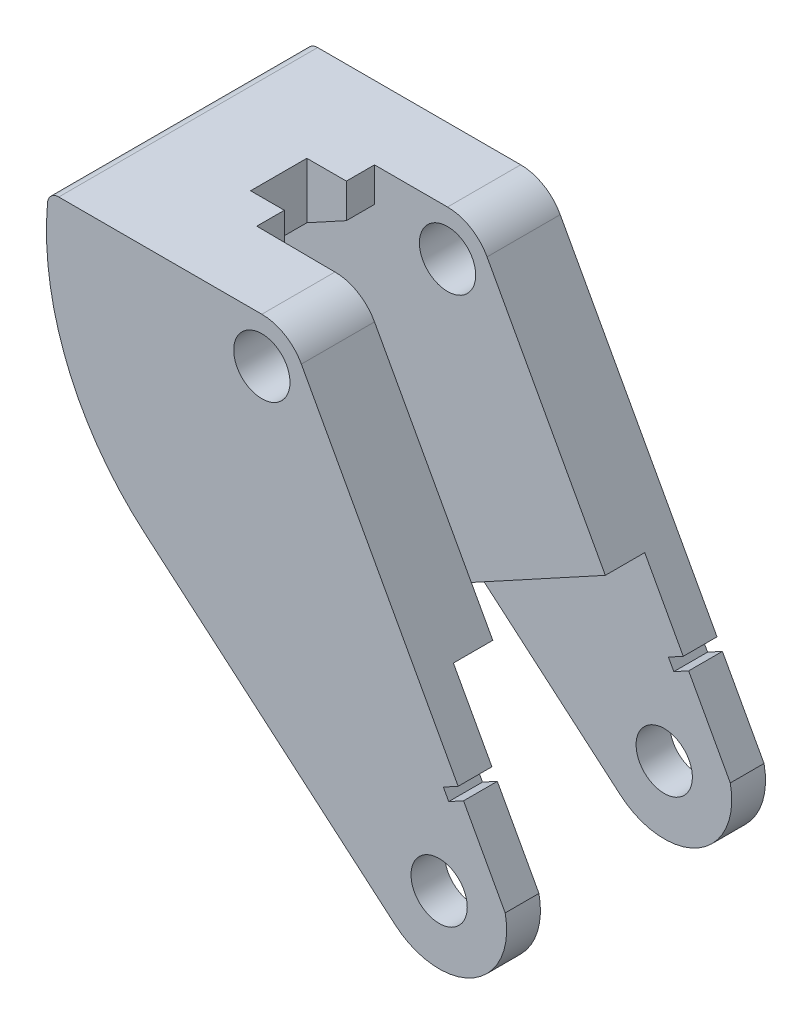
ISO-10303-21;
HEADER;
FILE_DESCRIPTION(('STEP AP214'),'2;1');
FILE_NAME('part.step','',(''),(''),'','','');
FILE_SCHEMA(('AUTOMOTIVE_DESIGN { 1 0 10303 214 1 1 1 1 }'));
ENDSEC;
DATA;
#1=APPLICATION_CONTEXT('core data for automotive mechanical design processes');
#2=APPLICATION_PROTOCOL_DEFINITION('international standard','automotive_design',2000,#1);
#3=PRODUCT_CONTEXT('',#1,'mechanical');
#4=PRODUCT('Part','Part','',(#3));
#5=PRODUCT_RELATED_PRODUCT_CATEGORY('part','',(#4));
#6=PRODUCT_DEFINITION_FORMATION('','',#4);
#7=PRODUCT_DEFINITION_CONTEXT('part definition',#1,'design');
#8=PRODUCT_DEFINITION('design','',#6,#7);
#9=PRODUCT_DEFINITION_SHAPE('','',#8);
#10=(LENGTH_UNIT() NAMED_UNIT(*) SI_UNIT(.MILLI.,.METRE.));
#11=(NAMED_UNIT(*) PLANE_ANGLE_UNIT() SI_UNIT($,.RADIAN.));
#12=(NAMED_UNIT(*) SI_UNIT($,.STERADIAN.) SOLID_ANGLE_UNIT());
#13=UNCERTAINTY_MEASURE_WITH_UNIT(LENGTH_MEASURE(1.E-05),#10,'distance_accuracy_value','');
#14=(GEOMETRIC_REPRESENTATION_CONTEXT(3) GLOBAL_UNCERTAINTY_ASSIGNED_CONTEXT((#13)) GLOBAL_UNIT_ASSIGNED_CONTEXT((#10,
#11,#12)) REPRESENTATION_CONTEXT('',''));
#15=CARTESIAN_POINT('',(0.,0.,0.));
#16=DIRECTION('',(0.,0.,1.));
#17=DIRECTION('',(1.,0.,0.));
#18=AXIS2_PLACEMENT_3D('',#15,#16,#17);
#19=CARTESIAN_POINT('',(40.6188611367098,-74.3954801828679,46.));
#20=DIRECTION('',(0.479211321332095,-0.877699555375954,0.));
#21=DIRECTION('',(0.877699555375954,0.479211321332095,0.));
#22=AXIS2_PLACEMENT_3D('',#19,#20,#21);
#23=PLANE('',#22);
#24=DIRECTION('',(-0.877699555375954,-0.479211321332095,0.));
#25=VECTOR('',#24,1.);
#26=CARTESIAN_POINT('',(40.6188611367098,-74.3954801828679,40.));
#27=LINE('',#26,#25);
#28=CARTESIAN_POINT('',(75.7704330288209,-55.2032279934461,40.));
#29=VERTEX_POINT('',#28);
#30=CARTESIAN_POINT('',(73.1373343626931,-56.6408619574424,40.));
#31=VERTEX_POINT('',#30);
#32=EDGE_CURVE('E343',#29,#31,#27,.T.);
#33=ORIENTED_EDGE('',*,*,#32,.F.);
#34=DIRECTION('',(0.,0.,-1.));
#35=VECTOR('',#34,1.);
#36=CARTESIAN_POINT('',(75.7704330288209,-55.2032279934461,46.));
#37=LINE('',#36,#35);
#38=CARTESIAN_POINT('',(75.7704330288209,-55.2032279934461,46.));
#39=VERTEX_POINT('',#38);
#40=EDGE_CURVE('E465',#39,#29,#37,.T.);
#41=ORIENTED_EDGE('',*,*,#40,.F.);
#42=DIRECTION('',(-0.877699555375954,-0.479211321332095,0.));
#43=VECTOR('',#42,1.);
#44=CARTESIAN_POINT('',(40.6188611367098,-74.3954801828679,46.));
#45=LINE('',#44,#43);
#46=CARTESIAN_POINT('',(73.137334362693,-56.6408619574424,46.));
#47=VERTEX_POINT('',#46);
#48=EDGE_CURVE('E369',#39,#47,#45,.T.);
#49=ORIENTED_EDGE('',*,*,#48,.T.);
#50=DIRECTION('',(0.,0.,-1.));
#51=VECTOR('',#50,1.);
#52=CARTESIAN_POINT('',(73.137334362693,-56.6408619574424,46.));
#53=LINE('',#52,#51);
#54=EDGE_CURVE('E433',#47,#31,#53,.T.);
#55=ORIENTED_EDGE('',*,*,#54,.T.);
#56=EDGE_LOOP('',(#33,#41,#49,#55));
#57=FACE_BOUND('',#56,.T.);
#58=ADVANCED_FACE('F35',(#57),#23,.T.);
#59=CARTESIAN_POINT('',(35.1515718921111,19.1922521894218,46.));
#60=DIRECTION('',(-0.877699555375954,-0.479211321332095,0.));
#61=DIRECTION('',(0.479211321332095,-0.877699555375954,0.));
#62=AXIS2_PLACEMENT_3D('',#59,#60,#61);
#63=PLANE('',#62);
#64=ORIENTED_EDGE('',*,*,#40,.T.);
#65=DIRECTION('',(0.479211321332095,-0.877699555375954,0.));
#66=VECTOR('',#65,1.);
#67=CARTESIAN_POINT('',(89.895231663342,-81.0735046948236,40.));
#68=LINE('',#67,#66);
#69=CARTESIAN_POINT('',(68.9243368415455,-42.6642596674693,40.));
#70=VERTEX_POINT('',#69);
#71=EDGE_CURVE('E310',#70,#29,#68,.T.);
#72=ORIENTED_EDGE('',*,*,#71,.F.);
#73=DIRECTION('',(0.,0.,1.));
#74=VECTOR('',#73,1.);
#75=CARTESIAN_POINT('',(68.9243368415455,-42.6642596674693,40.));
#76=LINE('',#75,#74);
#77=CARTESIAN_POINT('',(68.9243368415455,-42.6642596674693,33.));
#78=VERTEX_POINT('',#77);
#79=EDGE_CURVE('E306',#78,#70,#76,.T.);
#80=ORIENTED_EDGE('',*,*,#79,.F.);
#81=DIRECTION('',(0.479211321332095,-0.877699555375954,0.));
#82=VECTOR('',#81,1.);
#83=CARTESIAN_POINT('',(68.9243368415455,-42.6642596674693,33.));
#84=LINE('',#83,#82);
#85=CARTESIAN_POINT('',(47.9050102517225,-4.16630942934325,33.));
#86=VERTEX_POINT('',#85);
#87=EDGE_CURVE('E303',#86,#78,#84,.T.);
#88=ORIENTED_EDGE('',*,*,#87,.F.);
#89=DIRECTION('',(0.,0.,-1.));
#90=VECTOR('',#89,1.);
#91=CARTESIAN_POINT('',(47.9050102517225,-4.16630942934325,46.));
#92=LINE('',#91,#90);
#93=CARTESIAN_POINT('',(47.9050102517225,-4.16630942934325,46.));
#94=VERTEX_POINT('',#93);
#95=EDGE_CURVE('E461',#94,#86,#92,.T.);
#96=ORIENTED_EDGE('',*,*,#95,.F.);
#97=DIRECTION('',(-0.479211321332095,0.877699555375954,0.));
#98=VECTOR('',#97,1.);
#99=CARTESIAN_POINT('',(35.1515718921111,19.1922521894218,46.));
#100=LINE('',#99,#98);
#101=EDGE_CURVE('E372',#39,#94,#100,.T.);
#102=ORIENTED_EDGE('',*,*,#101,.F.);
#103=EDGE_LOOP('',(#64,#72,#80,#88,#96,#102));
#104=FACE_BOUND('',#103,.T.);
#105=ADVANCED_FACE('F540',(#104),#63,.F.);
#106=CARTESIAN_POINT('',(40.8834138087149,-8.00000000000001,46.));
#107=DIRECTION('',(0.,0.,-1.));
#108=DIRECTION('',(-1.,0.,0.));
#109=AXIS2_PLACEMENT_3D('',#106,#107,#108);
#110=CYLINDRICAL_SURFACE('',#109,7.99999999999999);
#111=CARTESIAN_POINT('',(40.8834138087149,-8.00000000000001,33.));
#112=DIRECTION('',(0.,0.,1.));
#113=DIRECTION('',(1.,0.,0.));
#114=AXIS2_PLACEMENT_3D('',#111,#112,#113);
#115=CIRCLE('',#114,7.99999999999999);
#116=CARTESIAN_POINT('',(40.8834138087149,0.,33.));
#117=VERTEX_POINT('',#116);
#118=EDGE_CURVE('E366',#117,#86,#115,.F.);
#119=ORIENTED_EDGE('',*,*,#118,.F.);
#120=DIRECTION('',(0.,0.,-1.));
#121=VECTOR('',#120,1.);
#122=CARTESIAN_POINT('',(40.8834138087149,0.,46.));
#123=LINE('',#122,#121);
#124=CARTESIAN_POINT('',(40.8834138087149,0.,46.));
#125=VERTEX_POINT('',#124);
#126=EDGE_CURVE('E457',#125,#117,#123,.T.);
#127=ORIENTED_EDGE('',*,*,#126,.F.);
#128=CARTESIAN_POINT('',(40.8834138087149,-8.00000000000001,46.));
#129=DIRECTION('',(0.,0.,1.));
#130=DIRECTION('',(1.,0.,0.));
#131=AXIS2_PLACEMENT_3D('',#128,#129,#130);
#132=CIRCLE('',#131,7.99999999999999);
#133=EDGE_CURVE('E375',#125,#94,#132,.F.);
#134=ORIENTED_EDGE('',*,*,#133,.T.);
#135=ORIENTED_EDGE('',*,*,#95,.T.);
#136=EDGE_LOOP('',(#119,#127,#134,#135));
#137=FACE_BOUND('',#136,.T.);
#138=ADVANCED_FACE('F530',(#137),#110,.T.);
#139=CARTESIAN_POINT('',(-13.3081912158622,-15.5799092450488,46.));
#140=DIRECTION('',(0.649495784414528,0.760365192540898,0.));
#141=DIRECTION('',(-0.760365192540898,0.649495784414528,0.));
#142=AXIS2_PLACEMENT_3D('',#139,#140,#141);
#143=PLANE('',#142);
#144=DIRECTION('',(0.,0.,1.));
#145=VECTOR('',#144,1.);
#146=CARTESIAN_POINT('',(38.1011923783447,-59.4932527954123,46.));
#147=LINE('',#146,#145);
#148=CARTESIAN_POINT('',(38.1011923783447,-59.4932527954123,33.));
#149=VERTEX_POINT('',#148);
#150=CARTESIAN_POINT('',(38.1011923783447,-59.4932527954123,40.));
#151=VERTEX_POINT('',#150);
#152=EDGE_CURVE('E479',#149,#151,#147,.T.);
#153=ORIENTED_EDGE('',*,*,#152,.T.);
#154=DIRECTION('',(0.760365192540898,-0.649495784414528,0.));
#155=VECTOR('',#154,1.);
#156=CARTESIAN_POINT('',(-13.3081912158622,-15.5799092450488,40.));
#157=LINE('',#156,#155);
#158=CARTESIAN_POINT('',(64.5954723476324,-82.1243823104908,40.));
#159=VERTEX_POINT('',#158);
#160=EDGE_CURVE('E348',#151,#159,#157,.T.);
#161=ORIENTED_EDGE('',*,*,#160,.T.);
#162=DIRECTION('',(0.,0.,-1.));
#163=VECTOR('',#162,1.);
#164=CARTESIAN_POINT('',(64.5954723476324,-82.1243823104908,46.));
#165=LINE('',#164,#163);
#166=CARTESIAN_POINT('',(64.5954723476324,-82.1243823104908,46.));
#167=VERTEX_POINT('',#166);
#168=EDGE_CURVE('E449',#167,#159,#165,.T.);
#169=ORIENTED_EDGE('',*,*,#168,.F.);
#170=DIRECTION('',(0.760365192540898,-0.649495784414528,0.));
#171=VECTOR('',#170,1.);
#172=CARTESIAN_POINT('',(-13.3081912158622,-15.5799092450488,46.));
#173=LINE('',#172,#171);
#174=CARTESIAN_POINT('',(20.054026367802,-44.0775573381979,46.));
#175=VERTEX_POINT('',#174);
#176=EDGE_CURVE('E382',#175,#167,#173,.T.);
#177=ORIENTED_EDGE('',*,*,#176,.F.);
#178=DIRECTION('',(0.,0.,-1.));
#179=VECTOR('',#178,1.);
#180=CARTESIAN_POINT('',(20.054026367802,-44.0775573381979,46.));
#181=LINE('',#180,#179);
#182=CARTESIAN_POINT('',(20.054026367802,-44.0775573381979,33.));
#183=VERTEX_POINT('',#182);
#184=EDGE_CURVE('E453',#175,#183,#181,.T.);
#185=ORIENTED_EDGE('',*,*,#184,.T.);
#186=DIRECTION('',(0.760365192540898,-0.649495784414528,0.));
#187=VECTOR('',#186,1.);
#188=CARTESIAN_POINT('',(-13.3081912158622,-15.5799092450488,33.));
#189=LINE('',#188,#187);
#190=EDGE_CURVE('E358',#183,#149,#189,.T.);
#191=ORIENTED_EDGE('',*,*,#190,.T.);
#192=EDGE_LOOP('',(#153,#161,#169,#177,#185,#191));
#193=FACE_BOUND('',#192,.T.);
#194=ADVANCED_FACE('F546',(#193),#143,.F.);
#195=CARTESIAN_POINT('',(72.3894217606068,-73.,46.));
#196=DIRECTION('',(0.,0.,-1.));
#197=DIRECTION('',(-1.,0.,0.));
#198=AXIS2_PLACEMENT_3D('',#195,#196,#197);
#199=CYLINDRICAL_SURFACE('',#198,12.);
#200=ORIENTED_EDGE('',*,*,#168,.T.);
#201=CARTESIAN_POINT('',(72.3894217606068,-73.,40.));
#202=DIRECTION('',(0.,0.,1.));
#203=DIRECTION('',(1.,0.,0.));
#204=AXIS2_PLACEMENT_3D('',#201,#202,#203);
#205=CIRCLE('',#204,12.);
#206=CARTESIAN_POINT('',(84.1285796544398,-70.5115924884262,40.));
#207=VERTEX_POINT('',#206);
#208=EDGE_CURVE('E345',#159,#207,#205,.T.);
#209=ORIENTED_EDGE('',*,*,#208,.T.);
#210=DIRECTION('',(0.,0.,-1.));
#211=VECTOR('',#210,1.);
#212=CARTESIAN_POINT('',(84.1285796544398,-70.5115924884262,46.));
#213=LINE('',#212,#211);
#214=CARTESIAN_POINT('',(84.1285796544398,-70.5115924884262,46.));
#215=VERTEX_POINT('',#214);
#216=EDGE_CURVE('E445',#215,#207,#213,.T.);
#217=ORIENTED_EDGE('',*,*,#216,.F.);
#218=CARTESIAN_POINT('',(72.3894217606068,-73.,46.));
#219=DIRECTION('',(0.,0.,1.));
#220=DIRECTION('',(1.,0.,0.));
#221=AXIS2_PLACEMENT_3D('',#218,#219,#220);
#222=CIRCLE('',#221,12.);
#223=EDGE_CURVE('E384',#167,#215,#222,.T.);
#224=ORIENTED_EDGE('',*,*,#223,.F.);
#225=EDGE_LOOP('',(#200,#209,#217,#224));
#226=FACE_BOUND('',#225,.T.);
#227=ADVANCED_FACE('F612',(#226),#199,.T.);
#228=CARTESIAN_POINT('',(35.1515718921111,19.1922521894218,46.));
#229=DIRECTION('',(-0.877699555375954,-0.479211321332095,0.));
#230=DIRECTION('',(0.479211321332095,-0.877699555375954,0.));
#231=AXIS2_PLACEMENT_3D('',#228,#229,#230);
#232=PLANE('',#231);
#233=ORIENTED_EDGE('',*,*,#216,.T.);
#234=CARTESIAN_POINT('',(76.7288556714851,-56.958627104198,40.));
#235=VERTEX_POINT('',#234);
#236=EDGE_CURVE('E309',#235,#207,#68,.T.);
#237=ORIENTED_EDGE('',*,*,#236,.F.);
#238=DIRECTION('',(0.,0.,-1.));
#239=VECTOR('',#238,1.);
#240=CARTESIAN_POINT('',(76.7288556714851,-56.958627104198,46.));
#241=LINE('',#240,#239);
#242=CARTESIAN_POINT('',(76.7288556714851,-56.958627104198,46.));
#243=VERTEX_POINT('',#242);
#244=EDGE_CURVE('E441',#243,#235,#241,.T.);
#245=ORIENTED_EDGE('',*,*,#244,.F.);
#246=DIRECTION('',(-0.479211321332095,0.877699555375954,0.));
#247=VECTOR('',#246,1.);
#248=CARTESIAN_POINT('',(35.1515718921111,19.1922521894218,46.));
#249=LINE('',#248,#247);
#250=EDGE_CURVE('E386',#215,#243,#249,.T.);
#251=ORIENTED_EDGE('',*,*,#250,.F.);
#252=EDGE_LOOP('',(#233,#237,#245,#251));
#253=FACE_BOUND('',#252,.T.);
#254=ADVANCED_FACE('F617',(#253),#232,.F.);
#255=CARTESIAN_POINT('',(41.5772837793736,-76.1508792936198,46.));
#256=DIRECTION('',(-0.479211321332092,0.877699555375956,0.));
#257=DIRECTION('',(-0.877699555375956,-0.479211321332092,0.));
#258=AXIS2_PLACEMENT_3D('',#255,#256,#257);
#259=PLANE('',#258);
#260=DIRECTION('',(0.877699555375956,0.479211321332092,0.));
#261=VECTOR('',#260,1.);
#262=CARTESIAN_POINT('',(41.5772837793736,-76.1508792936198,40.));
#263=LINE('',#262,#261);
#264=CARTESIAN_POINT('',(74.0957570053572,-58.3962610681942,40.));
#265=VERTEX_POINT('',#264);
#266=EDGE_CURVE('E341',#265,#235,#263,.T.);
#267=ORIENTED_EDGE('',*,*,#266,.F.);
#268=DIRECTION('',(0.,0.,-1.));
#269=VECTOR('',#268,1.);
#270=CARTESIAN_POINT('',(74.0957570053572,-58.3962610681943,46.));
#271=LINE('',#270,#269);
#272=CARTESIAN_POINT('',(74.0957570053572,-58.3962610681943,46.));
#273=VERTEX_POINT('',#272);
#274=EDGE_CURVE('E437',#273,#265,#271,.T.);
#275=ORIENTED_EDGE('',*,*,#274,.F.);
#276=DIRECTION('',(0.877699555375956,0.479211321332092,0.));
#277=VECTOR('',#276,1.);
#278=CARTESIAN_POINT('',(41.5772837793736,-76.1508792936198,46.));
#279=LINE('',#278,#277);
#280=EDGE_CURVE('E388',#273,#243,#279,.T.);
#281=ORIENTED_EDGE('',*,*,#280,.T.);
#282=ORIENTED_EDGE('',*,*,#244,.T.);
#283=EDGE_LOOP('',(#267,#275,#281,#282));
#284=FACE_BOUND('',#283,.T.);
#285=ADVANCED_FACE('F760',(#284),#259,.T.);
#286=CARTESIAN_POINT('',(40.8834138087149,-8.00000000000001,46.));
#287=DIRECTION('',(0.,0.,-1.));
#288=DIRECTION('',(-1.,0.,0.));
#289=AXIS2_PLACEMENT_3D('',#286,#287,#288);
#290=CYLINDRICAL_SURFACE('',#289,5.);
#291=CARTESIAN_POINT('',(40.8834138087149,-8.00000000000001,33.));
#292=DIRECTION('',(0.,0.,1.));
#293=DIRECTION('',(1.,0.,0.));
#294=AXIS2_PLACEMENT_3D('',#291,#292,#293);
#295=CIRCLE('',#294,5.);
#296=CARTESIAN_POINT('',(45.8834138087149,-8.00000000000001,33.));
#297=VERTEX_POINT('',#296);
#298=EDGE_CURVE('E357',#297,#297,#295,.T.);
#299=ORIENTED_EDGE('',*,*,#298,.F.);
#300=EDGE_LOOP('',(#299));
#301=FACE_BOUND('',#300,.T.);
#302=CARTESIAN_POINT('',(40.8834138087149,-8.00000000000001,46.));
#303=DIRECTION('',(0.,0.,1.));
#304=DIRECTION('',(1.,0.,0.));
#305=AXIS2_PLACEMENT_3D('',#302,#303,#304);
#306=CIRCLE('',#305,5.);
#307=CARTESIAN_POINT('',(45.8834138087149,-8.00000000000001,46.));
#308=VERTEX_POINT('',#307);
#309=EDGE_CURVE('E394',#308,#308,#306,.T.);
#310=ORIENTED_EDGE('',*,*,#309,.T.);
#311=EDGE_LOOP('',(#310));
#312=FACE_BOUND('',#311,.T.);
#313=ADVANCED_FACE('F805',(#301,#312),#290,.F.);
#314=CARTESIAN_POINT('',(32.5184732259833,17.7546182254255,46.));
#315=DIRECTION('',(0.877699555375955,0.479211321332094,0.));
#316=DIRECTION('',(-0.479211321332094,0.877699555375955,0.));
#317=AXIS2_PLACEMENT_3D('',#314,#315,#316);
#318=PLANE('',#317);
#319=DIRECTION('',(0.479211321332094,-0.877699555375955,0.));
#320=VECTOR('',#319,1.);
#321=CARTESIAN_POINT('',(32.5184732259833,17.7546182254255,40.));
#322=LINE('',#321,#320);
#323=EDGE_CURVE('E339',#31,#265,#322,.T.);
#324=ORIENTED_EDGE('',*,*,#323,.F.);
#325=ORIENTED_EDGE('',*,*,#54,.F.);
#326=DIRECTION('',(0.479211321332094,-0.877699555375955,0.));
#327=VECTOR('',#326,1.);
#328=CARTESIAN_POINT('',(32.5184732259833,17.7546182254255,46.));
#329=LINE('',#328,#327);
#330=EDGE_CURVE('E391',#47,#273,#329,.T.);
#331=ORIENTED_EDGE('',*,*,#330,.T.);
#332=ORIENTED_EDGE('',*,*,#274,.T.);
#333=EDGE_LOOP('',(#324,#325,#331,#332));
#334=FACE_BOUND('',#333,.T.);
#335=ADVANCED_FACE('F575',(#334),#318,.T.);
#336=CARTESIAN_POINT('',(72.3894217606068,-73.,46.));
#337=DIRECTION('',(0.,0.,-1.));
#338=DIRECTION('',(-1.,0.,0.));
#339=AXIS2_PLACEMENT_3D('',#336,#337,#338);
#340=CYLINDRICAL_SURFACE('',#339,5.00000000000686);
#341=CARTESIAN_POINT('',(72.3894217606068,-73.,40.));
#342=DIRECTION('',(0.,0.,1.));
#343=DIRECTION('',(1.,0.,0.));
#344=AXIS2_PLACEMENT_3D('',#341,#342,#343);
#345=CIRCLE('',#344,5.00000000000686);
#346=CARTESIAN_POINT('',(77.3894217606136,-73.,40.));
#347=VERTEX_POINT('',#346);
#348=EDGE_CURVE('E338',#347,#347,#345,.T.);
#349=ORIENTED_EDGE('',*,*,#348,.F.);
#350=EDGE_LOOP('',(#349));
#351=FACE_BOUND('',#350,.T.);
#352=CARTESIAN_POINT('',(72.3894217606068,-73.,46.));
#353=DIRECTION('',(0.,0.,1.));
#354=DIRECTION('',(1.,0.,0.));
#355=AXIS2_PLACEMENT_3D('',#352,#353,#354);
#356=CIRCLE('',#355,5.00000000000686);
#357=CARTESIAN_POINT('',(77.3894217606136,-73.,46.));
#358=VERTEX_POINT('',#357);
#359=EDGE_CURVE('E397',#358,#358,#356,.T.);
#360=ORIENTED_EDGE('',*,*,#359,.T.);
#361=EDGE_LOOP('',(#360));
#362=FACE_BOUND('',#361,.T.);
#363=ADVANCED_FACE('F567',(#351,#362),#340,.F.);
#364=DIRECTION('',(0.877699555375954,0.479211321332095,0.));
#365=VECTOR('',#364,1.);
#366=CARTESIAN_POINT('',(40.6188611367098,-74.3954801828679,5.99999999999999));
#367=LINE('',#366,#365);
#368=CARTESIAN_POINT('',(73.1373343626931,-56.6408619574424,5.99999999999999));
#369=VERTEX_POINT('',#368);
#370=CARTESIAN_POINT('',(75.7704330288209,-55.2032279934461,5.99999999999999));
#371=VERTEX_POINT('',#370);
#372=EDGE_CURVE('E330',#369,#371,#367,.T.);
#373=ORIENTED_EDGE('',*,*,#372,.F.);
#374=CARTESIAN_POINT('',(73.137334362693,-56.6408619574424,0.));
#375=VERTEX_POINT('',#374);
#376=EDGE_CURVE('E400',#369,#375,#53,.T.);
#377=ORIENTED_EDGE('',*,*,#376,.T.);
#378=DIRECTION('',(-0.877699555375954,-0.479211321332095,0.));
#379=VECTOR('',#378,1.);
#380=CARTESIAN_POINT('',(40.6188611367098,-74.3954801828679,0.));
#381=LINE('',#380,#379);
#382=CARTESIAN_POINT('',(75.7704330288209,-55.2032279934461,0.));
#383=VERTEX_POINT('',#382);
#384=EDGE_CURVE('E368',#383,#375,#381,.T.);
#385=ORIENTED_EDGE('',*,*,#384,.F.);
#386=EDGE_CURVE('E464',#371,#383,#37,.T.);
#387=ORIENTED_EDGE('',*,*,#386,.F.);
#388=EDGE_LOOP('',(#373,#377,#385,#387));
#389=FACE_BOUND('',#388,.T.);
#390=ADVANCED_FACE('F559',(#389),#23,.T.);
#391=CARTESIAN_POINT('',(47.9050102517225,-4.16630942934326,13.));
#392=VERTEX_POINT('',#391);
#393=CARTESIAN_POINT('',(47.9050102517225,-4.16630942934325,0.));
#394=VERTEX_POINT('',#393);
#395=EDGE_CURVE('E460',#392,#394,#92,.T.);
#396=ORIENTED_EDGE('',*,*,#395,.F.);
#397=DIRECTION('',(-0.479211321332095,0.877699555375954,0.));
#398=VECTOR('',#397,1.);
#399=CARTESIAN_POINT('',(68.9243368415455,-42.6642596674693,13.));
#400=LINE('',#399,#398);
#401=CARTESIAN_POINT('',(68.9243368415455,-42.6642596674693,13.));
#402=VERTEX_POINT('',#401);
#403=EDGE_CURVE('E301',#402,#392,#400,.T.);
#404=ORIENTED_EDGE('',*,*,#403,.F.);
#405=DIRECTION('',(0.,0.,1.));
#406=VECTOR('',#405,1.);
#407=CARTESIAN_POINT('',(68.9243368415455,-42.6642596674693,5.99999999999999));
#408=LINE('',#407,#406);
#409=CARTESIAN_POINT('',(68.9243368415455,-42.6642596674693,5.99999999999999));
#410=VERTEX_POINT('',#409);
#411=EDGE_CURVE('E298',#410,#402,#408,.T.);
#412=ORIENTED_EDGE('',*,*,#411,.F.);
#413=DIRECTION('',(-0.479211321332095,0.877699555375954,0.));
#414=VECTOR('',#413,1.);
#415=CARTESIAN_POINT('',(68.9243368415455,-42.6642596674693,5.99999999999999));
#416=LINE('',#415,#414);
#417=EDGE_CURVE('E294',#371,#410,#416,.T.);
#418=ORIENTED_EDGE('',*,*,#417,.F.);
#419=ORIENTED_EDGE('',*,*,#386,.T.);
#420=DIRECTION('',(-0.479211321332095,0.877699555375954,0.));
#421=VECTOR('',#420,1.);
#422=CARTESIAN_POINT('',(35.1515718921111,19.1922521894218,0.));
#423=LINE('',#422,#421);
#424=EDGE_CURVE('E403',#383,#394,#423,.T.);
#425=ORIENTED_EDGE('',*,*,#424,.T.);
#426=EDGE_LOOP('',(#396,#404,#412,#418,#419,#425));
#427=FACE_BOUND('',#426,.T.);
#428=ADVANCED_FACE('F564',(#427),#63,.F.);
#429=CARTESIAN_POINT('',(40.8834138087149,-8.00000000000001,13.));
#430=DIRECTION('',(0.,0.,-1.));
#431=DIRECTION('',(-1.,0.,0.));
#432=AXIS2_PLACEMENT_3D('',#429,#430,#431);
#433=CIRCLE('',#432,7.99999999999999);
#434=CARTESIAN_POINT('',(40.8834138087149,0.,13.));
#435=VERTEX_POINT('',#434);
#436=EDGE_CURVE('E246',#392,#435,#433,.F.);
#437=ORIENTED_EDGE('',*,*,#436,.F.);
#438=ORIENTED_EDGE('',*,*,#395,.T.);
#439=CARTESIAN_POINT('',(40.8834138087149,-8.00000000000001,0.));
#440=DIRECTION('',(0.,0.,1.));
#441=DIRECTION('',(1.,0.,0.));
#442=AXIS2_PLACEMENT_3D('',#439,#440,#441);
#443=CIRCLE('',#442,7.99999999999999);
#444=CARTESIAN_POINT('',(40.8834138087149,0.,0.));
#445=VERTEX_POINT('',#444);
#446=EDGE_CURVE('E406',#445,#394,#443,.F.);
#447=ORIENTED_EDGE('',*,*,#446,.F.);
#448=EDGE_CURVE('E456',#435,#445,#123,.T.);
#449=ORIENTED_EDGE('',*,*,#448,.F.);
#450=EDGE_LOOP('',(#437,#438,#447,#449));
#451=FACE_BOUND('',#450,.T.);
#452=ADVANCED_FACE('F573',(#451),#110,.T.);
#453=CARTESIAN_POINT('',(0.,0.,46.));
#454=DIRECTION('',(0.,1.,0.));
#455=DIRECTION('',(0.,0.,1.));
#456=AXIS2_PLACEMENT_3D('',#453,#454,#455);
#457=PLANE('',#456);
#458=DIRECTION('',(1.,0.,0.));
#459=VECTOR('',#458,1.);
#460=CARTESIAN_POINT('',(0.,0.,0.));
#461=LINE('',#460,#459);
#462=CARTESIAN_POINT('',(4.79613344294826,0.,0.));
#463=VERTEX_POINT('',#462);
#464=EDGE_CURVE('E409',#463,#445,#461,.T.);
#465=ORIENTED_EDGE('',*,*,#464,.F.);
#466=DIRECTION('',(0.,0.,1.));
#467=VECTOR('',#466,1.);
#468=CARTESIAN_POINT('',(4.79613344294826,0.,46.));
#469=LINE('',#468,#467);
#470=CARTESIAN_POINT('',(4.79613344294826,0.,46.));
#471=VERTEX_POINT('',#470);
#472=EDGE_CURVE('E43',#463,#471,#469,.T.);
#473=ORIENTED_EDGE('',*,*,#472,.T.);
#474=DIRECTION('',(1.,0.,0.));
#475=VECTOR('',#474,1.);
#476=CARTESIAN_POINT('',(0.,0.,46.));
#477=LINE('',#476,#475);
#478=EDGE_CURVE('E378',#471,#125,#477,.T.);
#479=ORIENTED_EDGE('',*,*,#478,.T.);
#480=ORIENTED_EDGE('',*,*,#126,.T.);
#481=DIRECTION('',(1.,0.,0.));
#482=VECTOR('',#481,1.);
#483=CARTESIAN_POINT('',(0.,0.,33.));
#484=LINE('',#483,#482);
#485=CARTESIAN_POINT('',(39.0579081442254,0.,33.));
#486=VERTEX_POINT('',#485);
#487=EDGE_CURVE('E364',#486,#117,#484,.T.);
#488=ORIENTED_EDGE('',*,*,#487,.F.);
#489=DIRECTION('',(0.999961675443081,0.,0.00875486408044823));
#490=VECTOR('',#489,1.);
#491=CARTESIAN_POINT('',(26.8834138087149,0.,32.893409871825));
#492=LINE('',#491,#490);
#493=CARTESIAN_POINT('',(26.8834138087149,0.,32.893409871825));
#494=VERTEX_POINT('',#493);
#495=EDGE_CURVE('E262',#494,#486,#492,.T.);
#496=ORIENTED_EDGE('',*,*,#495,.F.);
#497=DIRECTION('',(0.,0.,1.));
#498=VECTOR('',#497,1.);
#499=CARTESIAN_POINT('',(26.8834138087149,0.,28.));
#500=LINE('',#499,#498);
#501=CARTESIAN_POINT('',(26.8834138087149,0.,28.));
#502=VERTEX_POINT('',#501);
#503=EDGE_CURVE('E277',#502,#494,#500,.T.);
#504=ORIENTED_EDGE('',*,*,#503,.F.);
#505=DIRECTION('',(1.,0.,0.));
#506=VECTOR('',#505,1.);
#507=CARTESIAN_POINT('',(20.8834138087149,0.,28.));
#508=LINE('',#507,#506);
#509=CARTESIAN_POINT('',(20.8834138087149,0.,28.));
#510=VERTEX_POINT('',#509);
#511=EDGE_CURVE('E274',#510,#502,#508,.T.);
#512=ORIENTED_EDGE('',*,*,#511,.F.);
#513=DIRECTION('',(0.,0.,1.));
#514=VECTOR('',#513,1.);
#515=CARTESIAN_POINT('',(20.8834138087149,0.,18.));
#516=LINE('',#515,#514);
#517=CARTESIAN_POINT('',(20.8834138087149,0.,18.));
#518=VERTEX_POINT('',#517);
#519=EDGE_CURVE('E269',#518,#510,#516,.T.);
#520=ORIENTED_EDGE('',*,*,#519,.F.);
#521=DIRECTION('',(-1.,0.,0.));
#522=VECTOR('',#521,1.);
#523=CARTESIAN_POINT('',(27.9041506616551,0.,18.));
#524=LINE('',#523,#522);
#525=CARTESIAN_POINT('',(27.9041506616551,0.,18.));
#526=VERTEX_POINT('',#525);
#527=EDGE_CURVE('E267',#526,#518,#524,.T.);
#528=ORIENTED_EDGE('',*,*,#527,.F.);
#529=DIRECTION('',(0.,0.,1.));
#530=VECTOR('',#529,1.);
#531=CARTESIAN_POINT('',(27.9041506616551,0.,13.));
#532=LINE('',#531,#530);
#533=CARTESIAN_POINT('',(27.9041506616551,0.,13.));
#534=VERTEX_POINT('',#533);
#535=EDGE_CURVE('E256',#534,#526,#532,.T.);
#536=ORIENTED_EDGE('',*,*,#535,.F.);
#537=DIRECTION('',(-1.,0.,0.));
#538=VECTOR('',#537,1.);
#539=CARTESIAN_POINT('',(0.,0.,13.));
#540=LINE('',#539,#538);
#541=EDGE_CURVE('E238',#435,#534,#540,.T.);
#542=ORIENTED_EDGE('',*,*,#541,.F.);
#543=ORIENTED_EDGE('',*,*,#448,.T.);
#544=EDGE_LOOP('',(#465,#473,#479,#480,#488,#496,#504,#512,#520,#528,#536,#542,#543));
#545=FACE_BOUND('',#544,.T.);
#546=ADVANCED_FACE('F264',(#545),#457,.T.);
#547=CARTESIAN_POINT('',(52.3814632843233,-6.23180316206789,46.));
#548=DIRECTION('',(0.,0.,-1.));
#549=DIRECTION('',(-1.,0.,0.));
#550=AXIS2_PLACEMENT_3D('',#547,#548,#549);
#551=CYLINDRICAL_SURFACE('',#550,49.7731281591958);
#552=CARTESIAN_POINT('',(52.3814632843233,-6.23180316206789,46.));
#553=DIRECTION('',(0.,0.,1.));
#554=DIRECTION('',(1.,0.,0.));
#555=AXIS2_PLACEMENT_3D('',#552,#553,#554);
#556=CIRCLE('',#555,49.7731281591958);
#557=CARTESIAN_POINT('',(2.80399553299999,-1.82283751032731,46.));
#558=VERTEX_POINT('',#557);
#559=EDGE_CURVE('E380',#558,#175,#556,.T.);
#560=ORIENTED_EDGE('',*,*,#559,.F.);
#561=DIRECTION('',(0.,0.,-1.));
#562=VECTOR('',#561,1.);
#563=CARTESIAN_POINT('',(2.803995533,-1.82283751032731,46.));
#564=LINE('',#563,#562);
#565=CARTESIAN_POINT('',(2.80399553299999,-1.82283751032731,0.));
#566=VERTEX_POINT('',#565);
#567=EDGE_CURVE('E497',#558,#566,#564,.T.);
#568=ORIENTED_EDGE('',*,*,#567,.T.);
#569=CARTESIAN_POINT('',(52.3814632843233,-6.23180316206789,0.));
#570=DIRECTION('',(0.,0.,1.));
#571=DIRECTION('',(1.,0.,0.));
#572=AXIS2_PLACEMENT_3D('',#569,#570,#571);
#573=CIRCLE('',#572,49.7731281591958);
#574=CARTESIAN_POINT('',(20.054026367802,-44.0775573381979,0.));
#575=VERTEX_POINT('',#574);
#576=EDGE_CURVE('E411',#566,#575,#573,.T.);
#577=ORIENTED_EDGE('',*,*,#576,.T.);
#578=CARTESIAN_POINT('',(20.054026367802,-44.0775573381979,13.));
#579=VERTEX_POINT('',#578);
#580=EDGE_CURVE('E452',#579,#575,#181,.T.);
#581=ORIENTED_EDGE('',*,*,#580,.F.);
#582=CARTESIAN_POINT('',(52.3814632843233,-6.23180316206789,13.));
#583=DIRECTION('',(0.,0.,-1.));
#584=DIRECTION('',(-1.,0.,0.));
#585=AXIS2_PLACEMENT_3D('',#582,#583,#584);
#586=CIRCLE('',#585,49.7731281591958);
#587=CARTESIAN_POINT('',(4.27194766853972,-18.9926336196206,13.));
#588=VERTEX_POINT('',#587);
#589=EDGE_CURVE('E250',#579,#588,#586,.T.);
#590=ORIENTED_EDGE('',*,*,#589,.T.);
#591=DIRECTION('',(0.,0.,-1.));
#592=VECTOR('',#591,1.);
#593=CARTESIAN_POINT('',(4.27194766853971,-18.9926336196206,46.));
#594=LINE('',#593,#592);
#595=CARTESIAN_POINT('',(4.27194766853969,-18.9926336196206,33.));
#596=VERTEX_POINT('',#595);
#597=EDGE_CURVE('E482',#588,#596,#594,.F.);
#598=ORIENTED_EDGE('',*,*,#597,.T.);
#599=CARTESIAN_POINT('',(52.3814632843233,-6.23180316206789,33.));
#600=DIRECTION('',(0.,0.,1.));
#601=DIRECTION('',(1.,0.,0.));
#602=AXIS2_PLACEMENT_3D('',#599,#600,#601);
#603=CIRCLE('',#602,49.7731281591958);
#604=EDGE_CURVE('E361',#596,#183,#603,.T.);
#605=ORIENTED_EDGE('',*,*,#604,.T.);
#606=ORIENTED_EDGE('',*,*,#184,.F.);
#607=EDGE_LOOP('',(#560,#568,#577,#581,#590,#598,#605,#606));
#608=FACE_BOUND('',#607,.T.);
#609=ADVANCED_FACE('F503',(#608),#551,.T.);
#610=DIRECTION('',(0.,0.,1.));
#611=VECTOR('',#610,1.);
#612=CARTESIAN_POINT('',(38.1011923783448,-59.4932527954124,45.9999999999998));
#613=LINE('',#612,#611);
#614=CARTESIAN_POINT('',(38.1011923783447,-59.4932527954123,5.99999999999999));
#615=VERTEX_POINT('',#614);
#616=CARTESIAN_POINT('',(38.1011923783447,-59.4932527954123,13.));
#617=VERTEX_POINT('',#616);
#618=EDGE_CURVE('E468',#615,#617,#613,.T.);
#619=ORIENTED_EDGE('',*,*,#618,.T.);
#620=DIRECTION('',(-0.760365192540898,0.649495784414528,0.));
#621=VECTOR('',#620,1.);
#622=CARTESIAN_POINT('',(-13.3081912158622,-15.5799092450488,13.));
#623=LINE('',#622,#621);
#624=EDGE_CURVE('E352',#617,#579,#623,.T.);
#625=ORIENTED_EDGE('',*,*,#624,.T.);
#626=ORIENTED_EDGE('',*,*,#580,.T.);
#627=DIRECTION('',(0.760365192540898,-0.649495784414528,0.));
#628=VECTOR('',#627,1.);
#629=CARTESIAN_POINT('',(-13.3081912158622,-15.5799092450488,0.));
#630=LINE('',#629,#628);
#631=CARTESIAN_POINT('',(64.5954723476324,-82.1243823104908,0.));
#632=VERTEX_POINT('',#631);
#633=EDGE_CURVE('E413',#575,#632,#630,.T.);
#634=ORIENTED_EDGE('',*,*,#633,.T.);
#635=CARTESIAN_POINT('',(64.5954723476324,-82.1243823104908,5.99999999999998));
#636=VERTEX_POINT('',#635);
#637=EDGE_CURVE('E448',#636,#632,#165,.T.);
#638=ORIENTED_EDGE('',*,*,#637,.F.);
#639=DIRECTION('',(-0.760365192540898,0.649495784414528,0.));
#640=VECTOR('',#639,1.);
#641=CARTESIAN_POINT('',(-13.3081912158622,-15.5799092450488,6.));
#642=LINE('',#641,#640);
#643=EDGE_CURVE('E335',#636,#615,#642,.T.);
#644=ORIENTED_EDGE('',*,*,#643,.T.);
#645=EDGE_LOOP('',(#619,#625,#626,#634,#638,#644));
#646=FACE_BOUND('',#645,.T.);
#647=ADVANCED_FACE('F516',(#646),#143,.F.);
#648=CARTESIAN_POINT('',(84.1285796544398,-70.5115924884262,5.99999999999999));
#649=VERTEX_POINT('',#648);
#650=CARTESIAN_POINT('',(84.1285796544398,-70.5115924884262,0.));
#651=VERTEX_POINT('',#650);
#652=EDGE_CURVE('E444',#649,#651,#213,.T.);
#653=ORIENTED_EDGE('',*,*,#652,.F.);
#654=CARTESIAN_POINT('',(72.3894217606068,-73.,5.99999999999998));
#655=DIRECTION('',(0.,0.,-1.));
#656=DIRECTION('',(0.,1.,0.));
#657=AXIS2_PLACEMENT_3D('',#654,#655,#656);
#658=CIRCLE('',#657,12.);
#659=EDGE_CURVE('E332',#649,#636,#658,.T.);
#660=ORIENTED_EDGE('',*,*,#659,.T.);
#661=ORIENTED_EDGE('',*,*,#637,.T.);
#662=CARTESIAN_POINT('',(72.3894217606068,-73.,0.));
#663=DIRECTION('',(0.,0.,1.));
#664=DIRECTION('',(1.,0.,0.));
#665=AXIS2_PLACEMENT_3D('',#662,#663,#664);
#666=CIRCLE('',#665,12.);
#667=EDGE_CURVE('E416',#632,#651,#666,.T.);
#668=ORIENTED_EDGE('',*,*,#667,.T.);
#669=EDGE_LOOP('',(#653,#660,#661,#668));
#670=FACE_BOUND('',#669,.T.);
#671=ADVANCED_FACE('F620',(#670),#199,.T.);
#672=CARTESIAN_POINT('',(76.7288556714851,-56.958627104198,5.99999999999999));
#673=VERTEX_POINT('',#672);
#674=CARTESIAN_POINT('',(76.7288556714851,-56.958627104198,0.));
#675=VERTEX_POINT('',#674);
#676=EDGE_CURVE('E440',#673,#675,#241,.T.);
#677=ORIENTED_EDGE('',*,*,#676,.F.);
#678=EDGE_CURVE('E297',#649,#673,#416,.T.);
#679=ORIENTED_EDGE('',*,*,#678,.F.);
#680=ORIENTED_EDGE('',*,*,#652,.T.);
#681=DIRECTION('',(-0.479211321332095,0.877699555375954,0.));
#682=VECTOR('',#681,1.);
#683=CARTESIAN_POINT('',(35.1515718921111,19.1922521894218,0.));
#684=LINE('',#683,#682);
#685=EDGE_CURVE('E419',#651,#675,#684,.T.);
#686=ORIENTED_EDGE('',*,*,#685,.T.);
#687=EDGE_LOOP('',(#677,#679,#680,#686));
#688=FACE_BOUND('',#687,.T.);
#689=ADVANCED_FACE('F627',(#688),#232,.F.);
#690=DIRECTION('',(-0.877699555375956,-0.479211321332092,0.));
#691=VECTOR('',#690,1.);
#692=CARTESIAN_POINT('',(41.5772837793736,-76.1508792936198,5.99999999999999));
#693=LINE('',#692,#691);
#694=CARTESIAN_POINT('',(74.0957570053572,-58.3962610681943,5.99999999999998));
#695=VERTEX_POINT('',#694);
#696=EDGE_CURVE('E328',#673,#695,#693,.T.);
#697=ORIENTED_EDGE('',*,*,#696,.F.);
#698=ORIENTED_EDGE('',*,*,#676,.T.);
#699=DIRECTION('',(0.877699555375956,0.479211321332092,0.));
#700=VECTOR('',#699,1.);
#701=CARTESIAN_POINT('',(41.5772837793736,-76.1508792936198,0.));
#702=LINE('',#701,#700);
#703=CARTESIAN_POINT('',(74.0957570053572,-58.3962610681943,0.));
#704=VERTEX_POINT('',#703);
#705=EDGE_CURVE('E422',#704,#675,#702,.T.);
#706=ORIENTED_EDGE('',*,*,#705,.F.);
#707=EDGE_CURVE('E436',#695,#704,#271,.T.);
#708=ORIENTED_EDGE('',*,*,#707,.F.);
#709=EDGE_LOOP('',(#697,#698,#706,#708));
#710=FACE_BOUND('',#709,.T.);
#711=ADVANCED_FACE('F753',(#710),#259,.T.);
#712=CARTESIAN_POINT('',(40.8834138087149,-8.00000000000001,13.));
#713=DIRECTION('',(0.,0.,-1.));
#714=DIRECTION('',(-1.,0.,0.));
#715=AXIS2_PLACEMENT_3D('',#712,#713,#714);
#716=CIRCLE('',#715,5.);
#717=CARTESIAN_POINT('',(35.8834138087149,-8.00000000000001,13.));
#718=VERTEX_POINT('',#717);
#719=EDGE_CURVE('E351',#718,#718,#716,.T.);
#720=ORIENTED_EDGE('',*,*,#719,.F.);
#721=EDGE_LOOP('',(#720));
#722=FACE_BOUND('',#721,.T.);
#723=CARTESIAN_POINT('',(40.8834138087149,-8.00000000000001,0.));
#724=DIRECTION('',(0.,0.,1.));
#725=DIRECTION('',(1.,0.,0.));
#726=AXIS2_PLACEMENT_3D('',#723,#724,#725);
#727=CIRCLE('',#726,5.);
#728=CARTESIAN_POINT('',(45.8834138087149,-8.00000000000001,0.));
#729=VERTEX_POINT('',#728);
#730=EDGE_CURVE('E428',#729,#729,#727,.T.);
#731=ORIENTED_EDGE('',*,*,#730,.F.);
#732=EDGE_LOOP('',(#731));
#733=FACE_BOUND('',#732,.T.);
#734=ADVANCED_FACE('F746',(#722,#733),#290,.F.);
#735=DIRECTION('',(-0.479211321332094,0.877699555375955,0.));
#736=VECTOR('',#735,1.);
#737=CARTESIAN_POINT('',(32.5184732259833,17.7546182254255,6.));
#738=LINE('',#737,#736);
#739=EDGE_CURVE('E326',#695,#369,#738,.T.);
#740=ORIENTED_EDGE('',*,*,#739,.F.);
#741=ORIENTED_EDGE('',*,*,#707,.T.);
#742=DIRECTION('',(0.479211321332094,-0.877699555375955,0.));
#743=VECTOR('',#742,1.);
#744=CARTESIAN_POINT('',(32.5184732259833,17.7546182254255,0.));
#745=LINE('',#744,#743);
#746=EDGE_CURVE('E425',#375,#704,#745,.T.);
#747=ORIENTED_EDGE('',*,*,#746,.F.);
#748=ORIENTED_EDGE('',*,*,#376,.F.);
#749=EDGE_LOOP('',(#740,#741,#747,#748));
#750=FACE_BOUND('',#749,.T.);
#751=ADVANCED_FACE('F588',(#750),#318,.T.);
#752=CARTESIAN_POINT('',(72.3894217606068,-73.,5.99999999999998));
#753=DIRECTION('',(0.,0.,-1.));
#754=DIRECTION('',(0.,1.,0.));
#755=AXIS2_PLACEMENT_3D('',#752,#753,#754);
#756=CIRCLE('',#755,5.00000000000686);
#757=CARTESIAN_POINT('',(72.3894217606068,-67.9999999999932,5.99999999999999));
#758=VERTEX_POINT('',#757);
#759=EDGE_CURVE('E315',#758,#758,#756,.T.);
#760=ORIENTED_EDGE('',*,*,#759,.F.);
#761=EDGE_LOOP('',(#760));
#762=FACE_BOUND('',#761,.T.);
#763=CARTESIAN_POINT('',(72.3894217606068,-73.,0.));
#764=DIRECTION('',(0.,0.,1.));
#765=DIRECTION('',(1.,0.,0.));
#766=AXIS2_PLACEMENT_3D('',#763,#764,#765);
#767=CIRCLE('',#766,5.00000000000686);
#768=CARTESIAN_POINT('',(77.3894217606136,-73.,0.));
#769=VERTEX_POINT('',#768);
#770=EDGE_CURVE('E373',#769,#769,#767,.T.);
#771=ORIENTED_EDGE('',*,*,#770,.F.);
#772=EDGE_LOOP('',(#771));
#773=FACE_BOUND('',#772,.T.);
#774=ADVANCED_FACE('F578',(#762,#773),#340,.F.);
#775=CARTESIAN_POINT('',(0.,0.,46.));
#776=DIRECTION('',(0.,0.,1.));
#777=DIRECTION('',(1.,0.,0.));
#778=AXIS2_PLACEMENT_3D('',#775,#776,#777);
#779=PLANE('',#778);
#780=ORIENTED_EDGE('',*,*,#478,.F.);
#781=CARTESIAN_POINT('',(4.79613344294826,-2.,46.));
#782=DIRECTION('',(0.,0.,1.));
#783=DIRECTION('',(1.,0.,0.));
#784=AXIS2_PLACEMENT_3D('',#781,#782,#783);
#785=CIRCLE('',#784,2.);
#786=EDGE_CURVE('E11',#471,#558,#785,.T.);
#787=ORIENTED_EDGE('',*,*,#786,.T.);
#788=ORIENTED_EDGE('',*,*,#559,.T.);
#789=ORIENTED_EDGE('',*,*,#176,.T.);
#790=ORIENTED_EDGE('',*,*,#223,.T.);
#791=ORIENTED_EDGE('',*,*,#250,.T.);
#792=ORIENTED_EDGE('',*,*,#280,.F.);
#793=ORIENTED_EDGE('',*,*,#330,.F.);
#794=ORIENTED_EDGE('',*,*,#48,.F.);
#795=ORIENTED_EDGE('',*,*,#101,.T.);
#796=ORIENTED_EDGE('',*,*,#133,.F.);
#797=EDGE_LOOP('',(#780,#787,#788,#789,#790,#791,#792,#793,#794,#795,#796));
#798=FACE_BOUND('',#797,.T.);
#799=ORIENTED_EDGE('',*,*,#309,.F.);
#800=EDGE_LOOP('',(#799));
#801=FACE_BOUND('',#800,.T.);
#802=ORIENTED_EDGE('',*,*,#359,.F.);
#803=EDGE_LOOP('',(#802));
#804=FACE_BOUND('',#803,.T.);
#805=ADVANCED_FACE('F532',(#798,#801,#804),#779,.T.);
#806=CARTESIAN_POINT('',(0.,0.,0.));
#807=DIRECTION('',(0.,0.,1.));
#808=DIRECTION('',(1.,0.,0.));
#809=AXIS2_PLACEMENT_3D('',#806,#807,#808);
#810=PLANE('',#809);
#811=ORIENTED_EDGE('',*,*,#576,.F.);
#812=CARTESIAN_POINT('',(4.79613344294826,-2.,0.));
#813=DIRECTION('',(0.,0.,1.));
#814=DIRECTION('',(1.,0.,0.));
#815=AXIS2_PLACEMENT_3D('',#812,#813,#814);
#816=CIRCLE('',#815,2.);
#817=EDGE_CURVE('E57',#566,#463,#816,.F.);
#818=ORIENTED_EDGE('',*,*,#817,.T.);
#819=ORIENTED_EDGE('',*,*,#464,.T.);
#820=ORIENTED_EDGE('',*,*,#446,.T.);
#821=ORIENTED_EDGE('',*,*,#424,.F.);
#822=ORIENTED_EDGE('',*,*,#384,.T.);
#823=ORIENTED_EDGE('',*,*,#746,.T.);
#824=ORIENTED_EDGE('',*,*,#705,.T.);
#825=ORIENTED_EDGE('',*,*,#685,.F.);
#826=ORIENTED_EDGE('',*,*,#667,.F.);
#827=ORIENTED_EDGE('',*,*,#633,.F.);
#828=EDGE_LOOP('',(#811,#818,#819,#820,#821,#822,#823,#824,#825,#826,#827));
#829=FACE_BOUND('',#828,.T.);
#830=ORIENTED_EDGE('',*,*,#730,.T.);
#831=EDGE_LOOP('',(#830));
#832=FACE_BOUND('',#831,.T.);
#833=ORIENTED_EDGE('',*,*,#770,.T.);
#834=EDGE_LOOP('',(#833));
#835=FACE_BOUND('',#834,.T.);
#836=ADVANCED_FACE('F510',(#829,#832,#835),#810,.F.);
#837=CARTESIAN_POINT('',(-219.188900363086,-140.999039564941,13.));
#838=DIRECTION('',(-0.479211321332095,0.877699555375954,0.));
#839=DIRECTION('',(-0.877699555375954,-0.479211321332095,0.));
#840=AXIS2_PLACEMENT_3D('',#837,#838,#839);
#841=PLANE('',#840);
#842=DIRECTION('',(0.,0.,1.));
#843=VECTOR('',#842,1.);
#844=CARTESIAN_POINT('',(26.8834138087149,-6.64709863567276,13.));
#845=LINE('',#844,#843);
#846=CARTESIAN_POINT('',(26.8834138087149,-6.64709863567277,28.));
#847=VERTEX_POINT('',#846);
#848=CARTESIAN_POINT('',(26.8834138087149,-6.64709863567276,32.893409871825));
#849=VERTEX_POINT('',#848);
#850=EDGE_CURVE('E494',#847,#849,#845,.T.);
#851=ORIENTED_EDGE('',*,*,#850,.T.);
#852=DIRECTION('',(0.877673642207939,0.479197173115421,0.00768420793838697));
#853=VECTOR('',#852,1.);
#854=CARTESIAN_POINT('',(-219.308536185823,-141.064359001805,30.7379502048856));
#855=LINE('',#854,#853);
#856=EDGE_CURVE('E291',#849,#486,#855,.T.);
#857=ORIENTED_EDGE('',*,*,#856,.T.);
#858=DIRECTION('',(0.877699555375954,0.479211321332095,0.));
#859=VECTOR('',#858,1.);
#860=CARTESIAN_POINT('',(-219.188900363086,-140.999039564941,33.));
#861=LINE('',#860,#859);
#862=EDGE_CURVE('E318',#596,#486,#861,.T.);
#863=ORIENTED_EDGE('',*,*,#862,.F.);
#864=ORIENTED_EDGE('',*,*,#597,.F.);
#865=DIRECTION('',(0.877699555375954,0.479211321332095,0.));
#866=VECTOR('',#865,1.);
#867=CARTESIAN_POINT('',(-219.188900363086,-140.999039564941,13.));
#868=LINE('',#867,#866);
#869=CARTESIAN_POINT('',(27.9041506616551,-6.0897910091236,13.));
#870=VERTEX_POINT('',#869);
#871=EDGE_CURVE('E321',#588,#870,#868,.T.);
#872=ORIENTED_EDGE('',*,*,#871,.T.);
#873=DIRECTION('',(0.,0.,1.));
#874=VECTOR('',#873,1.);
#875=CARTESIAN_POINT('',(27.9041506616551,-6.0897910091236,13.));
#876=LINE('',#875,#874);
#877=CARTESIAN_POINT('',(27.9041506616551,-6.0897910091236,18.));
#878=VERTEX_POINT('',#877);
#879=EDGE_CURVE('E259',#870,#878,#876,.T.);
#880=ORIENTED_EDGE('',*,*,#879,.T.);
#881=DIRECTION('',(-0.877699555375954,-0.479211321332095,0.));
#882=VECTOR('',#881,1.);
#883=CARTESIAN_POINT('',(-219.188900363086,-140.999039564941,18.));
#884=LINE('',#883,#882);
#885=CARTESIAN_POINT('',(20.8834138087149,-9.92301225597877,18.));
#886=VERTEX_POINT('',#885);
#887=EDGE_CURVE('E485',#878,#886,#884,.T.);
#888=ORIENTED_EDGE('',*,*,#887,.T.);
#889=DIRECTION('',(0.,0.,1.));
#890=VECTOR('',#889,1.);
#891=CARTESIAN_POINT('',(20.8834138087149,-9.92301225597875,13.));
#892=LINE('',#891,#890);
#893=CARTESIAN_POINT('',(20.8834138087149,-9.92301225597875,28.));
#894=VERTEX_POINT('',#893);
#895=EDGE_CURVE('E488',#886,#894,#892,.T.);
#896=ORIENTED_EDGE('',*,*,#895,.T.);
#897=DIRECTION('',(0.877699555375954,0.479211321332095,0.));
#898=VECTOR('',#897,1.);
#899=CARTESIAN_POINT('',(-219.188900363086,-140.999039564941,28.));
#900=LINE('',#899,#898);
#901=EDGE_CURVE('E491',#894,#847,#900,.T.);
#902=ORIENTED_EDGE('',*,*,#901,.T.);
#903=EDGE_LOOP('',(#851,#857,#863,#864,#872,#880,#888,#896,#902));
#904=FACE_BOUND('',#903,.T.);
#905=ADVANCED_FACE('F519',(#904),#841,.F.);
#906=CARTESIAN_POINT('',(-194.385529771241,-186.427656067098,40.));
#907=DIRECTION('',(-0.479211321332095,0.877699555375954,0.));
#908=DIRECTION('',(-0.877699555375954,-0.479211321332095,0.));
#909=AXIS2_PLACEMENT_3D('',#906,#907,#908);
#910=PLANE('',#909);
#911=DIRECTION('',(0.877699555375954,0.479211321332095,0.));
#912=VECTOR('',#911,1.);
#913=CARTESIAN_POINT('',(-194.385529771241,-186.427656067098,33.));
#914=LINE('',#913,#912);
#915=EDGE_CURVE('E316',#149,#78,#914,.T.);
#916=ORIENTED_EDGE('',*,*,#915,.T.);
#917=ORIENTED_EDGE('',*,*,#79,.T.);
#918=DIRECTION('',(0.877699555375954,0.479211321332095,0.));
#919=VECTOR('',#918,1.);
#920=CARTESIAN_POINT('',(-194.385529771241,-186.427656067098,40.));
#921=LINE('',#920,#919);
#922=EDGE_CURVE('E313',#151,#70,#921,.T.);
#923=ORIENTED_EDGE('',*,*,#922,.F.);
#924=ORIENTED_EDGE('',*,*,#152,.F.);
#925=EDGE_LOOP('',(#916,#917,#923,#924));
#926=FACE_BOUND('',#925,.T.);
#927=ADVANCED_FACE('F856',(#926),#910,.F.);
#928=CARTESIAN_POINT('',(-194.385529771241,-186.427656067098,5.99999999999999));
#929=DIRECTION('',(-0.479211321332095,0.877699555375954,0.));
#930=DIRECTION('',(-0.877699555375954,-0.479211321332095,0.));
#931=AXIS2_PLACEMENT_3D('',#928,#929,#930);
#932=PLANE('',#931);
#933=DIRECTION('',(0.877699555375954,0.479211321332095,0.));
#934=VECTOR('',#933,1.);
#935=CARTESIAN_POINT('',(-194.385529771241,-186.427656067098,5.99999999999999));
#936=LINE('',#935,#934);
#937=EDGE_CURVE('E312',#615,#410,#936,.T.);
#938=ORIENTED_EDGE('',*,*,#937,.T.);
#939=ORIENTED_EDGE('',*,*,#411,.T.);
#940=DIRECTION('',(0.877699555375954,0.479211321332095,0.));
#941=VECTOR('',#940,1.);
#942=CARTESIAN_POINT('',(-194.385529771241,-186.427656067098,13.));
#943=LINE('',#942,#941);
#944=EDGE_CURVE('E323',#617,#402,#943,.T.);
#945=ORIENTED_EDGE('',*,*,#944,.F.);
#946=ORIENTED_EDGE('',*,*,#618,.F.);
#947=EDGE_LOOP('',(#938,#939,#945,#946));
#948=FACE_BOUND('',#947,.T.);
#949=ADVANCED_FACE('F599',(#948),#932,.F.);
#950=CARTESIAN_POINT('',(-194.385529771241,-186.427656067098,33.));
#951=DIRECTION('',(0.,0.,1.));
#952=DIRECTION('',(1.,0.,0.));
#953=AXIS2_PLACEMENT_3D('',#950,#951,#952);
#954=PLANE('',#953);
#955=ORIENTED_EDGE('',*,*,#298,.T.);
#956=EDGE_LOOP('',(#955));
#957=FACE_BOUND('',#956,.T.);
#958=ORIENTED_EDGE('',*,*,#862,.T.);
#959=ORIENTED_EDGE('',*,*,#487,.T.);
#960=ORIENTED_EDGE('',*,*,#118,.T.);
#961=ORIENTED_EDGE('',*,*,#87,.T.);
#962=ORIENTED_EDGE('',*,*,#915,.F.);
#963=ORIENTED_EDGE('',*,*,#190,.F.);
#964=ORIENTED_EDGE('',*,*,#604,.F.);
#965=EDGE_LOOP('',(#958,#959,#960,#961,#962,#963,#964));
#966=FACE_BOUND('',#965,.T.);
#967=ADVANCED_FACE('F523',(#957,#966),#954,.F.);
#968=CARTESIAN_POINT('',(-194.385529771241,-186.427656067098,13.));
#969=DIRECTION('',(0.,0.,-1.));
#970=DIRECTION('',(-1.,0.,0.));
#971=AXIS2_PLACEMENT_3D('',#968,#969,#970);
#972=PLANE('',#971);
#973=ORIENTED_EDGE('',*,*,#719,.T.);
#974=EDGE_LOOP('',(#973));
#975=FACE_BOUND('',#974,.T.);
#976=ORIENTED_EDGE('',*,*,#589,.F.);
#977=ORIENTED_EDGE('',*,*,#624,.F.);
#978=ORIENTED_EDGE('',*,*,#944,.T.);
#979=ORIENTED_EDGE('',*,*,#403,.T.);
#980=ORIENTED_EDGE('',*,*,#436,.T.);
#981=ORIENTED_EDGE('',*,*,#541,.T.);
#982=DIRECTION('',(0.,1.,0.));
#983=VECTOR('',#982,1.);
#984=CARTESIAN_POINT('',(27.9041506616551,-300.,13.));
#985=LINE('',#984,#983);
#986=EDGE_CURVE('E243',#870,#534,#985,.T.);
#987=ORIENTED_EDGE('',*,*,#986,.F.);
#988=ORIENTED_EDGE('',*,*,#871,.F.);
#989=EDGE_LOOP('',(#976,#977,#978,#979,#980,#981,#987,#988));
#990=FACE_BOUND('',#989,.T.);
#991=ADVANCED_FACE('F241',(#975,#990),#972,.F.);
#992=CARTESIAN_POINT('',(-173.414634949444,-224.836901094452,40.));
#993=DIRECTION('',(0.,0.,1.));
#994=DIRECTION('',(1.,0.,0.));
#995=AXIS2_PLACEMENT_3D('',#992,#993,#994);
#996=PLANE('',#995);
#997=ORIENTED_EDGE('',*,*,#348,.T.);
#998=EDGE_LOOP('',(#997));
#999=FACE_BOUND('',#998,.T.);
#1000=ORIENTED_EDGE('',*,*,#922,.T.);
#1001=ORIENTED_EDGE('',*,*,#71,.T.);
#1002=ORIENTED_EDGE('',*,*,#32,.T.);
#1003=ORIENTED_EDGE('',*,*,#323,.T.);
#1004=ORIENTED_EDGE('',*,*,#266,.T.);
#1005=ORIENTED_EDGE('',*,*,#236,.T.);
#1006=ORIENTED_EDGE('',*,*,#208,.F.);
#1007=ORIENTED_EDGE('',*,*,#160,.F.);
#1008=EDGE_LOOP('',(#1000,#1001,#1002,#1003,#1004,#1005,#1006,#1007));
#1009=FACE_BOUND('',#1008,.T.);
#1010=ADVANCED_FACE('F708',(#999,#1009),#996,.F.);
#1011=CARTESIAN_POINT('',(-194.385529771241,-186.427656067098,5.99999999999999));
#1012=DIRECTION('',(0.,0.,-1.));
#1013=DIRECTION('',(0.,1.,0.));
#1014=AXIS2_PLACEMENT_3D('',#1011,#1012,#1013);
#1015=PLANE('',#1014);
#1016=ORIENTED_EDGE('',*,*,#759,.T.);
#1017=EDGE_LOOP('',(#1016));
#1018=FACE_BOUND('',#1017,.T.);
#1019=ORIENTED_EDGE('',*,*,#659,.F.);
#1020=ORIENTED_EDGE('',*,*,#678,.T.);
#1021=ORIENTED_EDGE('',*,*,#696,.T.);
#1022=ORIENTED_EDGE('',*,*,#739,.T.);
#1023=ORIENTED_EDGE('',*,*,#372,.T.);
#1024=ORIENTED_EDGE('',*,*,#417,.T.);
#1025=ORIENTED_EDGE('',*,*,#937,.F.);
#1026=ORIENTED_EDGE('',*,*,#643,.F.);
#1027=EDGE_LOOP('',(#1019,#1020,#1021,#1022,#1023,#1024,#1025,#1026));
#1028=FACE_BOUND('',#1027,.T.);
#1029=ADVANCED_FACE('F597',(#1018,#1028),#1015,.F.);
#1030=CARTESIAN_POINT('',(26.8834138087149,-300.,28.));
#1031=DIRECTION('',(-1.,0.,0.));
#1032=DIRECTION('',(0.,0.,1.));
#1033=AXIS2_PLACEMENT_3D('',#1030,#1031,#1032);
#1034=PLANE('',#1033);
#1035=DIRECTION('',(0.,1.,0.));
#1036=VECTOR('',#1035,1.);
#1037=CARTESIAN_POINT('',(26.8834138087149,-300.,28.));
#1038=LINE('',#1037,#1036);
#1039=EDGE_CURVE('E283',#847,#502,#1038,.T.);
#1040=ORIENTED_EDGE('',*,*,#1039,.T.);
#1041=ORIENTED_EDGE('',*,*,#503,.T.);
#1042=DIRECTION('',(0.,1.,0.));
#1043=VECTOR('',#1042,1.);
#1044=CARTESIAN_POINT('',(26.8834138087149,-300.,32.893409871825));
#1045=LINE('',#1044,#1043);
#1046=EDGE_CURVE('E281',#849,#494,#1045,.T.);
#1047=ORIENTED_EDGE('',*,*,#1046,.F.);
#1048=ORIENTED_EDGE('',*,*,#850,.F.);
#1049=EDGE_LOOP('',(#1040,#1041,#1047,#1048));
#1050=FACE_BOUND('',#1049,.T.);
#1051=ADVANCED_FACE('F690',(#1050),#1034,.F.);
#1052=CARTESIAN_POINT('',(20.8834138087149,-300.,28.));
#1053=DIRECTION('',(0.,0.,1.));
#1054=DIRECTION('',(1.,0.,0.));
#1055=AXIS2_PLACEMENT_3D('',#1052,#1053,#1054);
#1056=PLANE('',#1055);
#1057=DIRECTION('',(0.,1.,0.));
#1058=VECTOR('',#1057,1.);
#1059=CARTESIAN_POINT('',(20.8834138087149,-300.,28.));
#1060=LINE('',#1059,#1058);
#1061=EDGE_CURVE('E285',#894,#510,#1060,.T.);
#1062=ORIENTED_EDGE('',*,*,#1061,.T.);
#1063=ORIENTED_EDGE('',*,*,#511,.T.);
#1064=ORIENTED_EDGE('',*,*,#1039,.F.);
#1065=ORIENTED_EDGE('',*,*,#901,.F.);
#1066=EDGE_LOOP('',(#1062,#1063,#1064,#1065));
#1067=FACE_BOUND('',#1066,.T.);
#1068=ADVANCED_FACE('F681',(#1067),#1056,.F.);
#1069=CARTESIAN_POINT('',(20.8834138087149,-300.,18.));
#1070=DIRECTION('',(-1.,0.,0.));
#1071=DIRECTION('',(0.,0.,1.));
#1072=AXIS2_PLACEMENT_3D('',#1069,#1070,#1071);
#1073=PLANE('',#1072);
#1074=DIRECTION('',(0.,1.,0.));
#1075=VECTOR('',#1074,1.);
#1076=CARTESIAN_POINT('',(20.8834138087149,-300.,18.));
#1077=LINE('',#1076,#1075);
#1078=EDGE_CURVE('E287',#886,#518,#1077,.T.);
#1079=ORIENTED_EDGE('',*,*,#1078,.T.);
#1080=ORIENTED_EDGE('',*,*,#519,.T.);
#1081=ORIENTED_EDGE('',*,*,#1061,.F.);
#1082=ORIENTED_EDGE('',*,*,#895,.F.);
#1083=EDGE_LOOP('',(#1079,#1080,#1081,#1082));
#1084=FACE_BOUND('',#1083,.T.);
#1085=ADVANCED_FACE('F672',(#1084),#1073,.F.);
#1086=CARTESIAN_POINT('',(27.9041506616551,-300.,18.));
#1087=DIRECTION('',(0.,0.,-1.));
#1088=DIRECTION('',(-1.,0.,0.));
#1089=AXIS2_PLACEMENT_3D('',#1086,#1087,#1088);
#1090=PLANE('',#1089);
#1091=DIRECTION('',(0.,1.,0.));
#1092=VECTOR('',#1091,1.);
#1093=CARTESIAN_POINT('',(27.9041506616551,-300.,18.));
#1094=LINE('',#1093,#1092);
#1095=EDGE_CURVE('E261',#878,#526,#1094,.T.);
#1096=ORIENTED_EDGE('',*,*,#1095,.T.);
#1097=ORIENTED_EDGE('',*,*,#527,.T.);
#1098=ORIENTED_EDGE('',*,*,#1078,.F.);
#1099=ORIENTED_EDGE('',*,*,#887,.F.);
#1100=EDGE_LOOP('',(#1096,#1097,#1098,#1099));
#1101=FACE_BOUND('',#1100,.T.);
#1102=ADVANCED_FACE('F663',(#1101),#1090,.F.);
#1103=CARTESIAN_POINT('',(26.8834138087149,-300.,32.893409871825));
#1104=DIRECTION('',(-0.00875486408044823,0.,0.999961675443081));
#1105=DIRECTION('',(0.999961675443081,0.,0.00875486408044823));
#1106=AXIS2_PLACEMENT_3D('',#1103,#1104,#1105);
#1107=PLANE('',#1106);
#1108=ORIENTED_EDGE('',*,*,#1046,.T.);
#1109=ORIENTED_EDGE('',*,*,#495,.T.);
#1110=ORIENTED_EDGE('',*,*,#856,.F.);
#1111=EDGE_LOOP('',(#1108,#1109,#1110));
#1112=FACE_BOUND('',#1111,.T.);
#1113=ADVANCED_FACE('F555',(#1112),#1107,.F.);
#1114=CARTESIAN_POINT('',(27.9041506616551,-300.,13.));
#1115=DIRECTION('',(-1.,0.,0.));
#1116=DIRECTION('',(0.,0.,1.));
#1117=AXIS2_PLACEMENT_3D('',#1114,#1115,#1116);
#1118=PLANE('',#1117);
#1119=ORIENTED_EDGE('',*,*,#986,.T.);
#1120=ORIENTED_EDGE('',*,*,#535,.T.);
#1121=ORIENTED_EDGE('',*,*,#1095,.F.);
#1122=ORIENTED_EDGE('',*,*,#879,.F.);
#1123=EDGE_LOOP('',(#1119,#1120,#1121,#1122));
#1124=FACE_BOUND('',#1123,.T.);
#1125=ADVANCED_FACE('F254',(#1124),#1118,.F.);
#1126=CARTESIAN_POINT('',(4.79613344294826,-2.,46.));
#1127=DIRECTION('',(0.,0.,-1.));
#1128=DIRECTION('',(-1.,0.,0.));
#1129=AXIS2_PLACEMENT_3D('',#1126,#1127,#1128);
#1130=CYLINDRICAL_SURFACE('',#1129,2.);
#1131=ORIENTED_EDGE('',*,*,#786,.F.);
#1132=ORIENTED_EDGE('',*,*,#472,.F.);
#1133=ORIENTED_EDGE('',*,*,#817,.F.);
#1134=ORIENTED_EDGE('',*,*,#567,.F.);
#1135=EDGE_LOOP('',(#1131,#1132,#1133,#1134));
#1136=FACE_BOUND('',#1135,.T.);
#1137=ADVANCED_FACE('F37',(#1136),#1130,.T.);
#1138=CLOSED_SHELL('',(#58,#105,#138,#194,#227,#254,#285,#313,#335,#363,#390,#428,#452,#546,
#609,#647,#671,#689,#711,#734,#751,#774,#805,#836,#905,#927,#949,#967,#991,#1010,#1029,#1051,
#1068,#1085,#1102,#1113,#1125,#1137));
#1139=MANIFOLD_SOLID_BREP('B2',#1138);
#1140=ADVANCED_BREP_SHAPE_REPRESENTATION('',(#18,#1139),#14);
#1141=SHAPE_DEFINITION_REPRESENTATION(#9,#1140);
ENDSEC;
END-ISO-10303-21;
